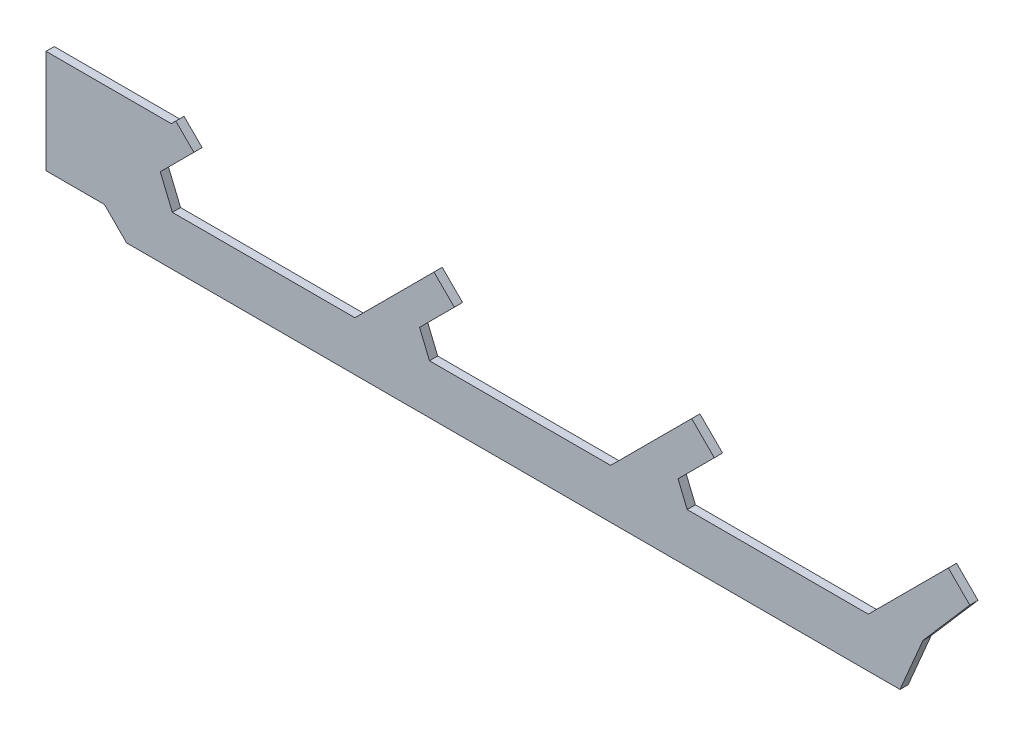
ISO-10303-21;
HEADER;
FILE_DESCRIPTION(('STEP AP214'),'2;1');
FILE_NAME('part.step','',(''),(''),'','','');
FILE_SCHEMA(('AUTOMOTIVE_DESIGN { 1 0 10303 214 1 1 1 1 }'));
ENDSEC;
DATA;
#1=APPLICATION_CONTEXT('core data for automotive mechanical design processes');
#2=APPLICATION_PROTOCOL_DEFINITION('international standard','automotive_design',2000,#1);
#3=PRODUCT_CONTEXT('',#1,'mechanical');
#4=PRODUCT('Part','Part','',(#3));
#5=PRODUCT_RELATED_PRODUCT_CATEGORY('part','',(#4));
#6=PRODUCT_DEFINITION_FORMATION('','',#4);
#7=PRODUCT_DEFINITION_CONTEXT('part definition',#1,'design');
#8=PRODUCT_DEFINITION('design','',#6,#7);
#9=PRODUCT_DEFINITION_SHAPE('','',#8);
#10=(LENGTH_UNIT() NAMED_UNIT(*) SI_UNIT(.MILLI.,.METRE.));
#11=(NAMED_UNIT(*) PLANE_ANGLE_UNIT() SI_UNIT($,.RADIAN.));
#12=(NAMED_UNIT(*) SI_UNIT($,.STERADIAN.) SOLID_ANGLE_UNIT());
#13=UNCERTAINTY_MEASURE_WITH_UNIT(LENGTH_MEASURE(1.E-05),#10,'distance_accuracy_value','');
#14=(GEOMETRIC_REPRESENTATION_CONTEXT(3) GLOBAL_UNCERTAINTY_ASSIGNED_CONTEXT((#13)) GLOBAL_UNIT_ASSIGNED_CONTEXT((#10,
#11,#12)) REPRESENTATION_CONTEXT('',''));
#15=CARTESIAN_POINT('',(0.,0.,0.));
#16=DIRECTION('',(0.,0.,1.));
#17=DIRECTION('',(1.,0.,0.));
#18=AXIS2_PLACEMENT_3D('',#15,#16,#17);
#19=CARTESIAN_POINT('',(35.0999984741211,68.5,0.));
#20=DIRECTION('',(-0.707108322558687,0.707105239811048,0.));
#21=DIRECTION('',(-0.707105239811048,-0.707108322558687,0.));
#22=AXIS2_PLACEMENT_3D('',#19,#20,#21);
#23=PLANE('',#22);
#24=DIRECTION('',(-0.707105239811048,-0.707108322558687,0.));
#25=VECTOR('',#24,1.);
#26=CARTESIAN_POINT('',(35.0999984741211,68.5,0.));
#27=LINE('',#26,#25);
#28=CARTESIAN_POINT('',(35.0999984741211,68.5,0.));
#29=VERTEX_POINT('',#28);
#30=CARTESIAN_POINT('',(34.2250022888184,67.625,0.));
#31=VERTEX_POINT('',#30);
#32=EDGE_CURVE('E11',#29,#31,#27,.T.);
#33=ORIENTED_EDGE('',*,*,#32,.T.);
#34=DIRECTION('',(0.,0.,1.));
#35=VECTOR('',#34,1.);
#36=CARTESIAN_POINT('',(34.2250022888184,67.625,0.));
#37=LINE('',#36,#35);
#38=CARTESIAN_POINT('',(34.2250022888184,67.625,1.59999930858612));
#39=VERTEX_POINT('',#38);
#40=EDGE_CURVE('E349',#31,#39,#37,.T.);
#41=ORIENTED_EDGE('',*,*,#40,.T.);
#42=DIRECTION('',(-0.707105239811048,-0.707108322558687,0.));
#43=VECTOR('',#42,1.);
#44=CARTESIAN_POINT('',(35.0999984741211,68.5,1.59999930858612));
#45=LINE('',#44,#43);
#46=CARTESIAN_POINT('',(35.0999984741211,68.5,1.59999930858612));
#47=VERTEX_POINT('',#46);
#48=EDGE_CURVE('E343',#47,#39,#45,.T.);
#49=ORIENTED_EDGE('',*,*,#48,.F.);
#50=DIRECTION('',(0.,0.,1.));
#51=VECTOR('',#50,1.);
#52=CARTESIAN_POINT('',(35.0999984741211,68.5,0.));
#53=LINE('',#52,#51);
#54=EDGE_CURVE('E193',#29,#47,#53,.T.);
#55=ORIENTED_EDGE('',*,*,#54,.F.);
#56=EDGE_LOOP('',(#33,#41,#49,#55));
#57=FACE_BOUND('',#56,.T.);
#58=ADVANCED_FACE('F17',(#57),#23,.T.);
#59=CARTESIAN_POINT('',(34.2250022888184,67.625,0.));
#60=DIRECTION('',(0.,1.,0.));
#61=DIRECTION('',(-1.,0.,0.));
#62=AXIS2_PLACEMENT_3D('',#59,#60,#61);
#63=PLANE('',#62);
#64=DIRECTION('',(-1.,0.,0.));
#65=VECTOR('',#64,1.);
#66=CARTESIAN_POINT('',(34.2250022888184,67.625,0.));
#67=LINE('',#66,#65);
#68=CARTESIAN_POINT('',(9.87499713897705,67.625,0.));
#69=VERTEX_POINT('',#68);
#70=EDGE_CURVE('E24',#31,#69,#67,.T.);
#71=ORIENTED_EDGE('',*,*,#70,.T.);
#72=DIRECTION('',(0.,0.,1.));
#73=VECTOR('',#72,1.);
#74=CARTESIAN_POINT('',(9.87499713897705,67.625,0.));
#75=LINE('',#74,#73);
#76=CARTESIAN_POINT('',(9.87499713897705,67.625,1.59999930858612));
#77=VERTEX_POINT('',#76);
#78=EDGE_CURVE('E345',#69,#77,#75,.T.);
#79=ORIENTED_EDGE('',*,*,#78,.T.);
#80=DIRECTION('',(-1.,0.,0.));
#81=VECTOR('',#80,1.);
#82=CARTESIAN_POINT('',(34.2250022888184,67.625,1.59999930858612));
#83=LINE('',#82,#81);
#84=EDGE_CURVE('E336',#39,#77,#83,.T.);
#85=ORIENTED_EDGE('',*,*,#84,.F.);
#86=ORIENTED_EDGE('',*,*,#40,.F.);
#87=EDGE_LOOP('',(#71,#79,#85,#86));
#88=FACE_BOUND('',#87,.T.);
#89=ADVANCED_FACE('F351',(#88),#63,.T.);
#90=CARTESIAN_POINT('',(9.87499713897705,67.625,0.));
#91=DIRECTION('',(-0.99999999999999,1.42339406987459E-07,0.));
#92=DIRECTION('',(-1.42339406987459E-07,-0.99999999999999,0.));
#93=AXIS2_PLACEMENT_3D('',#90,#91,#92);
#94=PLANE('',#93);
#95=DIRECTION('',(-1.42339406987459E-07,-0.99999999999999,0.));
#96=VECTOR('',#95,1.);
#97=CARTESIAN_POINT('',(9.87499713897705,67.625,0.));
#98=LINE('',#97,#96);
#99=CARTESIAN_POINT('',(9.8749942779541,47.5249938964844,0.));
#100=VERTEX_POINT('',#99);
#101=EDGE_CURVE('E347',#69,#100,#98,.T.);
#102=ORIENTED_EDGE('',*,*,#101,.T.);
#103=DIRECTION('',(0.,0.,1.));
#104=VECTOR('',#103,1.);
#105=CARTESIAN_POINT('',(9.8749942779541,47.5249938964844,0.));
#106=LINE('',#105,#104);
#107=CARTESIAN_POINT('',(9.8749942779541,47.5249938964844,1.59999930858612));
#108=VERTEX_POINT('',#107);
#109=EDGE_CURVE('E339',#100,#108,#106,.T.);
#110=ORIENTED_EDGE('',*,*,#109,.T.);
#111=DIRECTION('',(-1.42339406987459E-07,-0.99999999999999,0.));
#112=VECTOR('',#111,1.);
#113=CARTESIAN_POINT('',(9.87499713897705,67.625,1.59999930858612));
#114=LINE('',#113,#112);
#115=EDGE_CURVE('E328',#77,#108,#114,.T.);
#116=ORIENTED_EDGE('',*,*,#115,.F.);
#117=ORIENTED_EDGE('',*,*,#78,.F.);
#118=EDGE_LOOP('',(#102,#110,#116,#117));
#119=FACE_BOUND('',#118,.T.);
#120=ADVANCED_FACE('F355',(#119),#94,.T.);
#121=CARTESIAN_POINT('',(9.8749942779541,47.5249938964844,0.));
#122=DIRECTION('',(0.,-1.,0.));
#123=DIRECTION('',(1.,0.,0.));
#124=AXIS2_PLACEMENT_3D('',#121,#122,#123);
#125=PLANE('',#124);
#126=DIRECTION('',(1.,0.,0.));
#127=VECTOR('',#126,1.);
#128=CARTESIAN_POINT('',(9.8749942779541,47.5249938964844,0.));
#129=LINE('',#128,#127);
#130=CARTESIAN_POINT('',(21.2249965667725,47.5249938964844,0.));
#131=VERTEX_POINT('',#130);
#132=EDGE_CURVE('E341',#100,#131,#129,.T.);
#133=ORIENTED_EDGE('',*,*,#132,.T.);
#134=DIRECTION('',(0.,0.,1.));
#135=VECTOR('',#134,1.);
#136=CARTESIAN_POINT('',(21.2249965667725,47.5249938964844,0.));
#137=LINE('',#136,#135);
#138=CARTESIAN_POINT('',(21.2249965667725,47.5249938964844,1.59999930858612));
#139=VERTEX_POINT('',#138);
#140=EDGE_CURVE('E331',#131,#139,#137,.T.);
#141=ORIENTED_EDGE('',*,*,#140,.T.);
#142=DIRECTION('',(1.,0.,0.));
#143=VECTOR('',#142,1.);
#144=CARTESIAN_POINT('',(9.8749942779541,47.5249938964844,1.59999930858612));
#145=LINE('',#144,#143);
#146=EDGE_CURVE('E321',#108,#139,#145,.T.);
#147=ORIENTED_EDGE('',*,*,#146,.F.);
#148=ORIENTED_EDGE('',*,*,#109,.F.);
#149=EDGE_LOOP('',(#133,#141,#147,#148));
#150=FACE_BOUND('',#149,.T.);
#151=ADVANCED_FACE('F360',(#150),#125,.T.);
#152=CARTESIAN_POINT('',(21.2249965667725,47.5249938964844,0.));
#153=DIRECTION('',(-0.70710662526734,-0.707106937105721,0.));
#154=DIRECTION('',(0.707106937105721,-0.70710662526734,0.));
#155=AXIS2_PLACEMENT_3D('',#152,#153,#154);
#156=PLANE('',#155);
#157=DIRECTION('',(0.707106937105721,-0.70710662526734,0.));
#158=VECTOR('',#157,1.);
#159=CARTESIAN_POINT('',(21.2249965667725,47.5249938964844,0.));
#160=LINE('',#159,#158);
#161=CARTESIAN_POINT('',(25.549991607666,43.2000007629395,0.));
#162=VERTEX_POINT('',#161);
#163=EDGE_CURVE('E333',#131,#162,#160,.T.);
#164=ORIENTED_EDGE('',*,*,#163,.T.);
#165=DIRECTION('',(0.,0.,1.));
#166=VECTOR('',#165,1.);
#167=CARTESIAN_POINT('',(25.549991607666,43.2000007629395,0.));
#168=LINE('',#167,#166);
#169=CARTESIAN_POINT('',(25.549991607666,43.2000007629395,1.59999930858612));
#170=VERTEX_POINT('',#169);
#171=EDGE_CURVE('E324',#162,#170,#168,.T.);
#172=ORIENTED_EDGE('',*,*,#171,.T.);
#173=DIRECTION('',(0.707106937105721,-0.70710662526734,0.));
#174=VECTOR('',#173,1.);
#175=CARTESIAN_POINT('',(21.2249965667725,47.5249938964844,1.59999930858612));
#176=LINE('',#175,#174);
#177=EDGE_CURVE('E314',#139,#170,#176,.T.);
#178=ORIENTED_EDGE('',*,*,#177,.F.);
#179=ORIENTED_EDGE('',*,*,#140,.F.);
#180=EDGE_LOOP('',(#164,#172,#178,#179));
#181=FACE_BOUND('',#180,.T.);
#182=ADVANCED_FACE('F365',(#181),#156,.T.);
#183=CARTESIAN_POINT('',(25.549991607666,43.2000007629395,0.));
#184=DIRECTION('',(0.,-1.,0.));
#185=DIRECTION('',(1.,0.,0.));
#186=AXIS2_PLACEMENT_3D('',#183,#184,#185);
#187=PLANE('',#186);
#188=DIRECTION('',(1.,0.,0.));
#189=VECTOR('',#188,1.);
#190=CARTESIAN_POINT('',(25.549991607666,43.2000007629395,0.));
#191=LINE('',#190,#189);
#192=CARTESIAN_POINT('',(175.824981689453,43.2000007629395,0.));
#193=VERTEX_POINT('',#192);
#194=EDGE_CURVE('E326',#162,#193,#191,.T.);
#195=ORIENTED_EDGE('',*,*,#194,.T.);
#196=DIRECTION('',(0.,0.,1.));
#197=VECTOR('',#196,1.);
#198=CARTESIAN_POINT('',(175.824981689453,43.2000007629395,0.));
#199=LINE('',#198,#197);
#200=CARTESIAN_POINT('',(175.824981689453,43.2000007629395,1.59999930858612));
#201=VERTEX_POINT('',#200);
#202=EDGE_CURVE('E317',#193,#201,#199,.T.);
#203=ORIENTED_EDGE('',*,*,#202,.T.);
#204=DIRECTION('',(1.,0.,0.));
#205=VECTOR('',#204,1.);
#206=CARTESIAN_POINT('',(25.549991607666,43.2000007629395,1.59999930858612));
#207=LINE('',#206,#205);
#208=EDGE_CURVE('E307',#170,#201,#207,.T.);
#209=ORIENTED_EDGE('',*,*,#208,.F.);
#210=ORIENTED_EDGE('',*,*,#171,.F.);
#211=EDGE_LOOP('',(#195,#203,#209,#210));
#212=FACE_BOUND('',#211,.T.);
#213=ADVANCED_FACE('F370',(#212),#187,.T.);
#214=CARTESIAN_POINT('',(175.824981689453,43.2000007629395,0.));
#215=DIRECTION('',(0.919935540744426,-0.392069637788059,0.));
#216=DIRECTION('',(0.392069637788059,0.919935540744426,0.));
#217=AXIS2_PLACEMENT_3D('',#214,#215,#216);
#218=PLANE('',#217);
#219=DIRECTION('',(0.392069637788059,0.919935540744426,0.));
#220=VECTOR('',#219,1.);
#221=CARTESIAN_POINT('',(175.824981689453,43.2000007629395,0.));
#222=LINE('',#221,#220);
#223=CARTESIAN_POINT('',(180.300003051758,53.7000007629395,0.));
#224=VERTEX_POINT('',#223);
#225=EDGE_CURVE('E319',#193,#224,#222,.T.);
#226=ORIENTED_EDGE('',*,*,#225,.T.);
#227=DIRECTION('',(0.,0.,1.));
#228=VECTOR('',#227,1.);
#229=CARTESIAN_POINT('',(180.300003051758,53.7000007629395,0.));
#230=LINE('',#229,#228);
#231=CARTESIAN_POINT('',(180.300003051758,53.7000007629395,1.59999930858612));
#232=VERTEX_POINT('',#231);
#233=EDGE_CURVE('E310',#224,#232,#230,.T.);
#234=ORIENTED_EDGE('',*,*,#233,.T.);
#235=DIRECTION('',(0.392069637788059,0.919935540744426,0.));
#236=VECTOR('',#235,1.);
#237=CARTESIAN_POINT('',(175.824981689453,43.2000007629395,1.59999930858612));
#238=LINE('',#237,#236);
#239=EDGE_CURVE('E300',#201,#232,#238,.T.);
#240=ORIENTED_EDGE('',*,*,#239,.F.);
#241=ORIENTED_EDGE('',*,*,#202,.F.);
#242=EDGE_LOOP('',(#226,#234,#240,#241));
#243=FACE_BOUND('',#242,.T.);
#244=ADVANCED_FACE('F375',(#243),#218,.T.);
#245=CARTESIAN_POINT('',(180.300003051758,53.7000007629395,0.));
#246=DIRECTION('',(0.755748715648065,-0.654861724943747,0.));
#247=DIRECTION('',(0.654861724943747,0.755748715648065,0.));
#248=AXIS2_PLACEMENT_3D('',#245,#246,#247);
#249=PLANE('',#248);
#250=DIRECTION('',(0.654861724943747,0.755748715648065,0.));
#251=VECTOR('',#250,1.);
#252=CARTESIAN_POINT('',(180.300003051758,53.7000007629395,0.));
#253=LINE('',#252,#251);
#254=CARTESIAN_POINT('',(189.387496948242,64.1875,0.));
#255=VERTEX_POINT('',#254);
#256=EDGE_CURVE('E312',#224,#255,#253,.T.);
#257=ORIENTED_EDGE('',*,*,#256,.T.);
#258=DIRECTION('',(0.,0.,1.));
#259=VECTOR('',#258,1.);
#260=CARTESIAN_POINT('',(189.387496948242,64.1875,0.));
#261=LINE('',#260,#259);
#262=CARTESIAN_POINT('',(189.387496948242,64.1875,1.59999930858612));
#263=VERTEX_POINT('',#262);
#264=EDGE_CURVE('E303',#255,#263,#261,.T.);
#265=ORIENTED_EDGE('',*,*,#264,.T.);
#266=DIRECTION('',(0.654861724943747,0.755748715648065,0.));
#267=VECTOR('',#266,1.);
#268=CARTESIAN_POINT('',(180.300003051758,53.7000007629395,1.59999930858612));
#269=LINE('',#268,#267);
#270=EDGE_CURVE('E293',#232,#263,#269,.T.);
#271=ORIENTED_EDGE('',*,*,#270,.F.);
#272=ORIENTED_EDGE('',*,*,#233,.F.);
#273=EDGE_LOOP('',(#257,#265,#271,#272));
#274=FACE_BOUND('',#273,.T.);
#275=ADVANCED_FACE('F380',(#274),#249,.T.);
#276=CARTESIAN_POINT('',(189.387496948242,64.1875,0.));
#277=DIRECTION('',(0.70710613316299,0.707107429209511,0.));
#278=DIRECTION('',(-0.707107429209511,0.70710613316299,0.));
#279=AXIS2_PLACEMENT_3D('',#276,#277,#278);
#280=PLANE('',#279);
#281=DIRECTION('',(-0.707107429209511,0.70710613316299,0.));
#282=VECTOR('',#281,1.);
#283=CARTESIAN_POINT('',(189.387496948242,64.1875,0.));
#284=LINE('',#283,#282);
#285=CARTESIAN_POINT('',(185.224990844727,68.3499984741211,0.));
#286=VERTEX_POINT('',#285);
#287=EDGE_CURVE('E305',#255,#286,#284,.T.);
#288=ORIENTED_EDGE('',*,*,#287,.T.);
#289=DIRECTION('',(0.,0.,1.));
#290=VECTOR('',#289,1.);
#291=CARTESIAN_POINT('',(185.224990844727,68.3499984741211,0.));
#292=LINE('',#291,#290);
#293=CARTESIAN_POINT('',(185.224990844727,68.3499984741211,1.59999930858612));
#294=VERTEX_POINT('',#293);
#295=EDGE_CURVE('E296',#286,#294,#292,.T.);
#296=ORIENTED_EDGE('',*,*,#295,.T.);
#297=DIRECTION('',(-0.707107429209511,0.70710613316299,0.));
#298=VECTOR('',#297,1.);
#299=CARTESIAN_POINT('',(189.387496948242,64.1875,1.59999930858612));
#300=LINE('',#299,#298);
#301=EDGE_CURVE('E286',#263,#294,#300,.T.);
#302=ORIENTED_EDGE('',*,*,#301,.F.);
#303=ORIENTED_EDGE('',*,*,#264,.F.);
#304=EDGE_LOOP('',(#288,#296,#302,#303));
#305=FACE_BOUND('',#304,.T.);
#306=ADVANCED_FACE('F385',(#305),#280,.T.);
#307=CARTESIAN_POINT('',(185.224990844727,68.3499984741211,0.));
#308=DIRECTION('',(-0.707106781186548,0.707106781186548,0.));
#309=DIRECTION('',(-0.707106781186548,-0.707106781186548,0.));
#310=AXIS2_PLACEMENT_3D('',#307,#308,#309);
#311=PLANE('',#310);
#312=DIRECTION('',(-0.707106781186548,-0.707106781186548,0.));
#313=VECTOR('',#312,1.);
#314=CARTESIAN_POINT('',(185.224990844727,68.3499984741211,0.));
#315=LINE('',#314,#313);
#316=CARTESIAN_POINT('',(169.674957275391,52.7999649047852,0.));
#317=VERTEX_POINT('',#316);
#318=EDGE_CURVE('E298',#286,#317,#315,.T.);
#319=ORIENTED_EDGE('',*,*,#318,.T.);
#320=DIRECTION('',(0.,0.,1.));
#321=VECTOR('',#320,1.);
#322=CARTESIAN_POINT('',(169.674957275391,52.7999649047852,0.));
#323=LINE('',#322,#321);
#324=CARTESIAN_POINT('',(169.674957275391,52.7999649047852,1.59999930858612));
#325=VERTEX_POINT('',#324);
#326=EDGE_CURVE('E289',#317,#325,#323,.T.);
#327=ORIENTED_EDGE('',*,*,#326,.T.);
#328=DIRECTION('',(-0.707106781186548,-0.707106781186548,0.));
#329=VECTOR('',#328,1.);
#330=CARTESIAN_POINT('',(185.224990844727,68.3499984741211,1.59999930858612));
#331=LINE('',#330,#329);
#332=EDGE_CURVE('E279',#294,#325,#331,.T.);
#333=ORIENTED_EDGE('',*,*,#332,.F.);
#334=ORIENTED_EDGE('',*,*,#295,.F.);
#335=EDGE_LOOP('',(#319,#327,#333,#334));
#336=FACE_BOUND('',#335,.T.);
#337=ADVANCED_FACE('F390',(#336),#311,.T.);
#338=CARTESIAN_POINT('',(169.674957275391,52.7999649047852,0.));
#339=DIRECTION('',(3.25100347640621E-07,0.999999999999947,0.));
#340=DIRECTION('',(-0.999999999999947,3.25100347640621E-07,0.));
#341=AXIS2_PLACEMENT_3D('',#338,#339,#340);
#342=PLANE('',#341);
#343=DIRECTION('',(-0.999999999999947,3.25100347640621E-07,0.));
#344=VECTOR('',#343,1.);
#345=CARTESIAN_POINT('',(169.674957275391,52.7999649047852,0.));
#346=LINE('',#345,#344);
#347=CARTESIAN_POINT('',(134.473236083984,52.799976348877,0.));
#348=VERTEX_POINT('',#347);
#349=EDGE_CURVE('E291',#317,#348,#346,.T.);
#350=ORIENTED_EDGE('',*,*,#349,.T.);
#351=DIRECTION('',(0.,0.,1.));
#352=VECTOR('',#351,1.);
#353=CARTESIAN_POINT('',(134.473236083984,52.799976348877,0.));
#354=LINE('',#353,#352);
#355=CARTESIAN_POINT('',(134.473236083984,52.799976348877,1.59999930858612));
#356=VERTEX_POINT('',#355);
#357=EDGE_CURVE('E282',#348,#356,#354,.T.);
#358=ORIENTED_EDGE('',*,*,#357,.T.);
#359=DIRECTION('',(-0.999999999999947,3.25100347640621E-07,0.));
#360=VECTOR('',#359,1.);
#361=CARTESIAN_POINT('',(169.674957275391,52.7999649047852,1.59999930858612));
#362=LINE('',#361,#360);
#363=EDGE_CURVE('E272',#325,#356,#362,.T.);
#364=ORIENTED_EDGE('',*,*,#363,.F.);
#365=ORIENTED_EDGE('',*,*,#326,.F.);
#366=EDGE_LOOP('',(#350,#358,#364,#365));
#367=FACE_BOUND('',#366,.T.);
#368=ADVANCED_FACE('F395',(#367),#342,.T.);
#369=CARTESIAN_POINT('',(134.473236083984,52.799976348877,0.));
#370=DIRECTION('',(0.923878799643942,0.382685201658582,0.));
#371=DIRECTION('',(-0.382685201658582,0.923878799643942,0.));
#372=AXIS2_PLACEMENT_3D('',#369,#370,#371);
#373=PLANE('',#372);
#374=DIRECTION('',(-0.382685201658582,0.923878799643942,0.));
#375=VECTOR('',#374,1.);
#376=CARTESIAN_POINT('',(134.473236083984,52.799976348877,0.));
#377=LINE('',#376,#375);
#378=CARTESIAN_POINT('',(132.694412231445,57.0944137573242,0.));
#379=VERTEX_POINT('',#378);
#380=EDGE_CURVE('E284',#348,#379,#377,.T.);
#381=ORIENTED_EDGE('',*,*,#380,.T.);
#382=DIRECTION('',(0.,0.,1.));
#383=VECTOR('',#382,1.);
#384=CARTESIAN_POINT('',(132.694412231445,57.0944137573242,0.));
#385=LINE('',#384,#383);
#386=CARTESIAN_POINT('',(132.694412231445,57.0944137573242,1.59999930858612));
#387=VERTEX_POINT('',#386);
#388=EDGE_CURVE('E275',#379,#387,#385,.T.);
#389=ORIENTED_EDGE('',*,*,#388,.T.);
#390=DIRECTION('',(-0.382685201658582,0.923878799643942,0.));
#391=VECTOR('',#390,1.);
#392=CARTESIAN_POINT('',(134.473236083984,52.799976348877,1.59999930858612));
#393=LINE('',#392,#391);
#394=EDGE_CURVE('E265',#356,#387,#393,.T.);
#395=ORIENTED_EDGE('',*,*,#394,.F.);
#396=ORIENTED_EDGE('',*,*,#357,.F.);
#397=EDGE_LOOP('',(#381,#389,#395,#396));
#398=FACE_BOUND('',#397,.T.);
#399=ADVANCED_FACE('F400',(#398),#373,.T.);
#400=CARTESIAN_POINT('',(132.694412231445,57.0944137573242,0.));
#401=DIRECTION('',(0.707106398879562,-0.707107163493327,0.));
#402=DIRECTION('',(0.707107163493327,0.707106398879562,0.));
#403=AXIS2_PLACEMENT_3D('',#400,#401,#402);
#404=PLANE('',#403);
#405=DIRECTION('',(0.707107163493327,0.707106398879562,0.));
#406=VECTOR('',#405,1.);
#407=CARTESIAN_POINT('',(132.694412231445,57.0944137573242,0.));
#408=LINE('',#407,#406);
#409=CARTESIAN_POINT('',(139.75,64.1499938964844,0.));
#410=VERTEX_POINT('',#409);
#411=EDGE_CURVE('E277',#379,#410,#408,.T.);
#412=ORIENTED_EDGE('',*,*,#411,.T.);
#413=DIRECTION('',(0.,0.,1.));
#414=VECTOR('',#413,1.);
#415=CARTESIAN_POINT('',(139.75,64.1499938964844,0.));
#416=LINE('',#415,#414);
#417=CARTESIAN_POINT('',(139.75,64.1499938964844,1.59999930858612));
#418=VERTEX_POINT('',#417);
#419=EDGE_CURVE('E268',#410,#418,#416,.T.);
#420=ORIENTED_EDGE('',*,*,#419,.T.);
#421=DIRECTION('',(0.707107163493327,0.707106398879562,0.));
#422=VECTOR('',#421,1.);
#423=CARTESIAN_POINT('',(132.694412231445,57.0944137573242,1.59999930858612));
#424=LINE('',#423,#422);
#425=EDGE_CURVE('E258',#387,#418,#424,.T.);
#426=ORIENTED_EDGE('',*,*,#425,.F.);
#427=ORIENTED_EDGE('',*,*,#388,.F.);
#428=EDGE_LOOP('',(#412,#420,#426,#427));
#429=FACE_BOUND('',#428,.T.);
#430=ADVANCED_FACE('F405',(#429),#404,.T.);
#431=CARTESIAN_POINT('',(139.75,64.1499938964844,0.));
#432=DIRECTION('',(0.707108007275198,0.707105555095771,0.));
#433=DIRECTION('',(-0.707105555095771,0.707108007275198,0.));
#434=AXIS2_PLACEMENT_3D('',#431,#432,#433);
#435=PLANE('',#434);
#436=DIRECTION('',(-0.707105555095771,0.707108007275198,0.));
#437=VECTOR('',#436,1.);
#438=CARTESIAN_POINT('',(139.75,64.1499938964844,0.));
#439=LINE('',#438,#437);
#440=CARTESIAN_POINT('',(135.350006103516,68.5500030517578,0.));
#441=VERTEX_POINT('',#440);
#442=EDGE_CURVE('E270',#410,#441,#439,.T.);
#443=ORIENTED_EDGE('',*,*,#442,.T.);
#444=DIRECTION('',(0.,0.,1.));
#445=VECTOR('',#444,1.);
#446=CARTESIAN_POINT('',(135.350006103516,68.5500030517578,0.));
#447=LINE('',#446,#445);
#448=CARTESIAN_POINT('',(135.350006103516,68.5500030517578,1.59999930858612));
#449=VERTEX_POINT('',#448);
#450=EDGE_CURVE('E261',#441,#449,#447,.T.);
#451=ORIENTED_EDGE('',*,*,#450,.T.);
#452=DIRECTION('',(-0.707105555095771,0.707108007275198,0.));
#453=VECTOR('',#452,1.);
#454=CARTESIAN_POINT('',(139.75,64.1499938964844,1.59999930858612));
#455=LINE('',#454,#453);
#456=EDGE_CURVE('E251',#418,#449,#455,.T.);
#457=ORIENTED_EDGE('',*,*,#456,.F.);
#458=ORIENTED_EDGE('',*,*,#419,.F.);
#459=EDGE_LOOP('',(#443,#451,#457,#458));
#460=FACE_BOUND('',#459,.T.);
#461=ADVANCED_FACE('F410',(#460),#435,.T.);
#462=CARTESIAN_POINT('',(135.350006103516,68.5500030517578,0.));
#463=DIRECTION('',(-0.707106866818224,0.707106695554861,0.));
#464=DIRECTION('',(-0.707106695554861,-0.707106866818224,0.));
#465=AXIS2_PLACEMENT_3D('',#462,#463,#464);
#466=PLANE('',#465);
#467=DIRECTION('',(-0.707106695554861,-0.707106866818224,0.));
#468=VECTOR('',#467,1.);
#469=CARTESIAN_POINT('',(135.350006103516,68.5500030517578,0.));
#470=LINE('',#469,#468);
#471=CARTESIAN_POINT('',(119.600006103516,52.7999992370605,0.));
#472=VERTEX_POINT('',#471);
#473=EDGE_CURVE('E263',#441,#472,#470,.T.);
#474=ORIENTED_EDGE('',*,*,#473,.T.);
#475=DIRECTION('',(0.,0.,1.));
#476=VECTOR('',#475,1.);
#477=CARTESIAN_POINT('',(119.600006103516,52.7999992370605,0.));
#478=LINE('',#477,#476);
#479=CARTESIAN_POINT('',(119.600006103516,52.7999992370605,1.59999930858612));
#480=VERTEX_POINT('',#479);
#481=EDGE_CURVE('E254',#472,#480,#478,.T.);
#482=ORIENTED_EDGE('',*,*,#481,.T.);
#483=DIRECTION('',(-0.707106695554861,-0.707106866818224,0.));
#484=VECTOR('',#483,1.);
#485=CARTESIAN_POINT('',(135.350006103516,68.5500030517578,1.59999930858612));
#486=LINE('',#485,#484);
#487=EDGE_CURVE('E244',#449,#480,#486,.T.);
#488=ORIENTED_EDGE('',*,*,#487,.F.);
#489=ORIENTED_EDGE('',*,*,#450,.F.);
#490=EDGE_LOOP('',(#474,#482,#488,#489));
#491=FACE_BOUND('',#490,.T.);
#492=ADVANCED_FACE('F415',(#491),#466,.T.);
#493=CARTESIAN_POINT('',(119.600006103516,52.7999992370605,0.));
#494=DIRECTION('',(0.,1.,0.));
#495=DIRECTION('',(-1.,0.,0.));
#496=AXIS2_PLACEMENT_3D('',#493,#494,#495);
#497=PLANE('',#496);
#498=DIRECTION('',(-1.,0.,0.));
#499=VECTOR('',#498,1.);
#500=CARTESIAN_POINT('',(119.600006103516,52.7999992370605,0.));
#501=LINE('',#500,#499);
#502=CARTESIAN_POINT('',(84.3964462280273,52.7999992370605,0.));
#503=VERTEX_POINT('',#502);
#504=EDGE_CURVE('E256',#472,#503,#501,.T.);
#505=ORIENTED_EDGE('',*,*,#504,.T.);
#506=DIRECTION('',(0.,0.,1.));
#507=VECTOR('',#506,1.);
#508=CARTESIAN_POINT('',(84.3964462280273,52.7999992370605,0.));
#509=LINE('',#508,#507);
#510=CARTESIAN_POINT('',(84.3964462280273,52.7999992370605,1.59999930858612));
#511=VERTEX_POINT('',#510);
#512=EDGE_CURVE('E247',#503,#511,#509,.T.);
#513=ORIENTED_EDGE('',*,*,#512,.T.);
#514=DIRECTION('',(-1.,0.,0.));
#515=VECTOR('',#514,1.);
#516=CARTESIAN_POINT('',(119.600006103516,52.7999992370605,1.59999930858612));
#517=LINE('',#516,#515);
#518=EDGE_CURVE('E237',#480,#511,#517,.T.);
#519=ORIENTED_EDGE('',*,*,#518,.F.);
#520=ORIENTED_EDGE('',*,*,#481,.F.);
#521=EDGE_LOOP('',(#505,#513,#519,#520));
#522=FACE_BOUND('',#521,.T.);
#523=ADVANCED_FACE('F420',(#522),#497,.T.);
#524=CARTESIAN_POINT('',(84.3964462280273,52.7999992370605,0.));
#525=DIRECTION('',(0.923878328049887,0.382686340179193,0.));
#526=DIRECTION('',(-0.382686340179193,0.923878328049887,0.));
#527=AXIS2_PLACEMENT_3D('',#524,#525,#526);
#528=PLANE('',#527);
#529=DIRECTION('',(-0.382686340179193,0.923878328049887,0.));
#530=VECTOR('',#529,1.);
#531=CARTESIAN_POINT('',(84.3964462280273,52.7999992370605,0.));
#532=LINE('',#531,#530);
#533=CARTESIAN_POINT('',(82.4643783569336,57.4643821716309,0.));
#534=VERTEX_POINT('',#533);
#535=EDGE_CURVE('E249',#503,#534,#532,.T.);
#536=ORIENTED_EDGE('',*,*,#535,.T.);
#537=DIRECTION('',(0.,0.,1.));
#538=VECTOR('',#537,1.);
#539=CARTESIAN_POINT('',(82.4643783569336,57.4643821716309,0.));
#540=LINE('',#539,#538);
#541=CARTESIAN_POINT('',(82.4643783569336,57.4643821716309,1.59999930858612));
#542=VERTEX_POINT('',#541);
#543=EDGE_CURVE('E240',#534,#542,#540,.T.);
#544=ORIENTED_EDGE('',*,*,#543,.T.);
#545=DIRECTION('',(-0.382686340179193,0.923878328049887,0.));
#546=VECTOR('',#545,1.);
#547=CARTESIAN_POINT('',(84.3964462280273,52.7999992370605,1.59999930858612));
#548=LINE('',#547,#546);
#549=EDGE_CURVE('E230',#511,#542,#548,.T.);
#550=ORIENTED_EDGE('',*,*,#549,.F.);
#551=ORIENTED_EDGE('',*,*,#512,.F.);
#552=EDGE_LOOP('',(#536,#544,#550,#551));
#553=FACE_BOUND('',#552,.T.);
#554=ADVANCED_FACE('F425',(#553),#528,.T.);
#555=CARTESIAN_POINT('',(82.4643783569336,57.4643821716309,0.));
#556=DIRECTION('',(0.707106581693054,-0.707106980679984,0.));
#557=DIRECTION('',(0.707106980679984,0.707106581693054,0.));
#558=AXIS2_PLACEMENT_3D('',#555,#556,#557);
#559=PLANE('',#558);
#560=DIRECTION('',(0.707106980679984,0.707106581693054,0.));
#561=VECTOR('',#560,1.);
#562=CARTESIAN_POINT('',(82.4643783569336,57.4643821716309,0.));
#563=LINE('',#562,#561);
#564=CARTESIAN_POINT('',(89.2249984741211,64.2249984741211,0.));
#565=VERTEX_POINT('',#564);
#566=EDGE_CURVE('E242',#534,#565,#563,.T.);
#567=ORIENTED_EDGE('',*,*,#566,.T.);
#568=DIRECTION('',(0.,0.,1.));
#569=VECTOR('',#568,1.);
#570=CARTESIAN_POINT('',(89.2249984741211,64.2249984741211,0.));
#571=LINE('',#570,#569);
#572=CARTESIAN_POINT('',(89.2249984741211,64.2249984741211,1.59999930858612));
#573=VERTEX_POINT('',#572);
#574=EDGE_CURVE('E233',#565,#573,#571,.T.);
#575=ORIENTED_EDGE('',*,*,#574,.T.);
#576=DIRECTION('',(0.707106980679984,0.707106581693054,0.));
#577=VECTOR('',#576,1.);
#578=CARTESIAN_POINT('',(82.4643783569336,57.4643821716309,1.59999930858612));
#579=LINE('',#578,#577);
#580=EDGE_CURVE('E223',#542,#573,#579,.T.);
#581=ORIENTED_EDGE('',*,*,#580,.F.);
#582=ORIENTED_EDGE('',*,*,#543,.F.);
#583=EDGE_LOOP('',(#567,#575,#581,#582));
#584=FACE_BOUND('',#583,.T.);
#585=ADVANCED_FACE('F430',(#584),#559,.T.);
#586=CARTESIAN_POINT('',(89.2249984741211,64.2249984741211,0.));
#587=DIRECTION('',(0.707106098300703,0.707107464071733,0.));
#588=DIRECTION('',(-0.707107464071733,0.707106098300703,0.));
#589=AXIS2_PLACEMENT_3D('',#586,#587,#588);
#590=PLANE('',#589);
#591=DIRECTION('',(-0.707107464071733,0.707106098300703,0.));
#592=VECTOR('',#591,1.);
#593=CARTESIAN_POINT('',(89.2249984741211,64.2249984741211,0.));
#594=LINE('',#593,#592);
#595=CARTESIAN_POINT('',(85.2749938964844,68.1749954223633,0.));
#596=VERTEX_POINT('',#595);
#597=EDGE_CURVE('E235',#565,#596,#594,.T.);
#598=ORIENTED_EDGE('',*,*,#597,.T.);
#599=DIRECTION('',(0.,0.,1.));
#600=VECTOR('',#599,1.);
#601=CARTESIAN_POINT('',(85.2749938964844,68.1749954223633,0.));
#602=LINE('',#601,#600);
#603=CARTESIAN_POINT('',(85.2749938964844,68.1749954223633,1.59999930858612));
#604=VERTEX_POINT('',#603);
#605=EDGE_CURVE('E226',#596,#604,#602,.T.);
#606=ORIENTED_EDGE('',*,*,#605,.T.);
#607=DIRECTION('',(-0.707107464071733,0.707106098300703,0.));
#608=VECTOR('',#607,1.);
#609=CARTESIAN_POINT('',(89.2249984741211,64.2249984741211,1.59999930858612));
#610=LINE('',#609,#608);
#611=EDGE_CURVE('E216',#573,#604,#610,.T.);
#612=ORIENTED_EDGE('',*,*,#611,.F.);
#613=ORIENTED_EDGE('',*,*,#574,.F.);
#614=EDGE_LOOP('',(#598,#606,#612,#613));
#615=FACE_BOUND('',#614,.T.);
#616=ADVANCED_FACE('F435',(#615),#590,.T.);
#617=CARTESIAN_POINT('',(85.2749938964844,68.1749954223633,0.));
#618=DIRECTION('',(-0.707106693466261,0.707106868906823,0.));
#619=DIRECTION('',(-0.707106868906823,-0.707106693466261,0.));
#620=AXIS2_PLACEMENT_3D('',#617,#618,#619);
#621=PLANE('',#620);
#622=DIRECTION('',(-0.707106868906823,-0.707106693466261,0.));
#623=VECTOR('',#622,1.);
#624=CARTESIAN_POINT('',(85.2749938964844,68.1749954223633,0.));
#625=LINE('',#624,#623);
#626=CARTESIAN_POINT('',(69.8999938964844,52.7999992370605,0.));
#627=VERTEX_POINT('',#626);
#628=EDGE_CURVE('E228',#596,#627,#625,.T.);
#629=ORIENTED_EDGE('',*,*,#628,.T.);
#630=DIRECTION('',(0.,0.,1.));
#631=VECTOR('',#630,1.);
#632=CARTESIAN_POINT('',(69.8999938964844,52.7999992370605,0.));
#633=LINE('',#632,#631);
#634=CARTESIAN_POINT('',(69.8999938964844,52.7999992370605,1.59999930858612));
#635=VERTEX_POINT('',#634);
#636=EDGE_CURVE('E219',#627,#635,#633,.T.);
#637=ORIENTED_EDGE('',*,*,#636,.T.);
#638=DIRECTION('',(-0.707106868906823,-0.707106693466261,0.));
#639=VECTOR('',#638,1.);
#640=CARTESIAN_POINT('',(85.2749938964844,68.1749954223633,1.59999930858612));
#641=LINE('',#640,#639);
#642=EDGE_CURVE('E209',#604,#635,#641,.T.);
#643=ORIENTED_EDGE('',*,*,#642,.F.);
#644=ORIENTED_EDGE('',*,*,#605,.F.);
#645=EDGE_LOOP('',(#629,#637,#643,#644));
#646=FACE_BOUND('',#645,.T.);
#647=ADVANCED_FACE('F440',(#646),#621,.T.);
#648=CARTESIAN_POINT('',(69.8999938964844,52.7999992370605,0.));
#649=DIRECTION('',(0.,1.,0.));
#650=DIRECTION('',(-1.,0.,0.));
#651=AXIS2_PLACEMENT_3D('',#648,#649,#650);
#652=PLANE('',#651);
#653=DIRECTION('',(-1.,0.,0.));
#654=VECTOR('',#653,1.);
#655=CARTESIAN_POINT('',(69.8999938964844,52.7999992370605,0.));
#656=LINE('',#655,#654);
#657=CARTESIAN_POINT('',(34.4282455444336,52.7999992370605,0.));
#658=VERTEX_POINT('',#657);
#659=EDGE_CURVE('E221',#627,#658,#656,.T.);
#660=ORIENTED_EDGE('',*,*,#659,.T.);
#661=DIRECTION('',(0.,0.,1.));
#662=VECTOR('',#661,1.);
#663=CARTESIAN_POINT('',(34.4282455444336,52.7999992370605,0.));
#664=LINE('',#663,#662);
#665=CARTESIAN_POINT('',(34.4282455444336,52.7999992370605,1.59999930858612));
#666=VERTEX_POINT('',#665);
#667=EDGE_CURVE('E212',#658,#666,#664,.T.);
#668=ORIENTED_EDGE('',*,*,#667,.T.);
#669=DIRECTION('',(-1.,0.,0.));
#670=VECTOR('',#669,1.);
#671=CARTESIAN_POINT('',(69.8999938964844,52.7999992370605,1.59999930858612));
#672=LINE('',#671,#670);
#673=EDGE_CURVE('E204',#635,#666,#672,.T.);
#674=ORIENTED_EDGE('',*,*,#673,.F.);
#675=ORIENTED_EDGE('',*,*,#636,.F.);
#676=EDGE_LOOP('',(#660,#668,#674,#675));
#677=FACE_BOUND('',#676,.T.);
#678=ADVANCED_FACE('F444',(#677),#652,.T.);
#679=CARTESIAN_POINT('',(34.4282455444336,52.7999992370605,0.));
#680=DIRECTION('',(0.923879395146937,0.382683763991798,0.));
#681=DIRECTION('',(-0.382683763991798,0.923879395146937,0.));
#682=AXIS2_PLACEMENT_3D('',#679,#680,#681);
#683=PLANE('',#682);
#684=DIRECTION('',(-0.382683763991798,0.923879395146937,0.));
#685=VECTOR('',#684,1.);
#686=CARTESIAN_POINT('',(34.4282455444336,52.7999992370605,0.));
#687=LINE('',#686,#685);
#688=CARTESIAN_POINT('',(32.0841484069824,58.4591445922852,0.));
#689=VERTEX_POINT('',#688);
#690=EDGE_CURVE('E214',#658,#689,#687,.T.);
#691=ORIENTED_EDGE('',*,*,#690,.T.);
#692=DIRECTION('',(0.,0.,1.));
#693=VECTOR('',#692,1.);
#694=CARTESIAN_POINT('',(32.0841484069824,58.4591445922852,0.));
#695=LINE('',#694,#693);
#696=CARTESIAN_POINT('',(32.0841484069824,58.4591445922852,1.59999930858612));
#697=VERTEX_POINT('',#696);
#698=EDGE_CURVE('E206',#689,#697,#695,.T.);
#699=ORIENTED_EDGE('',*,*,#698,.T.);
#700=DIRECTION('',(-0.382683763991798,0.923879395146937,0.));
#701=VECTOR('',#700,1.);
#702=CARTESIAN_POINT('',(34.4282455444336,52.7999992370605,1.59999930858612));
#703=LINE('',#702,#701);
#704=EDGE_CURVE('E187',#666,#697,#703,.T.);
#705=ORIENTED_EDGE('',*,*,#704,.F.);
#706=ORIENTED_EDGE('',*,*,#667,.F.);
#707=EDGE_LOOP('',(#691,#699,#705,#706));
#708=FACE_BOUND('',#707,.T.);
#709=ADVANCED_FACE('F449',(#708),#683,.T.);
#710=CARTESIAN_POINT('',(32.0841484069824,58.4591445922852,0.));
#711=DIRECTION('',(0.707107607550448,-0.707105954821681,0.));
#712=DIRECTION('',(0.707105954821681,0.707107607550448,0.));
#713=AXIS2_PLACEMENT_3D('',#710,#711,#712);
#714=PLANE('',#713);
#715=DIRECTION('',(0.707105954821681,0.707107607550448,0.));
#716=VECTOR('',#715,1.);
#717=CARTESIAN_POINT('',(32.0841484069824,58.4591445922852,0.));
#718=LINE('',#717,#716);
#719=CARTESIAN_POINT('',(38.612491607666,64.9875030517578,0.));
#720=VERTEX_POINT('',#719);
#721=EDGE_CURVE('E182',#689,#720,#718,.T.);
#722=ORIENTED_EDGE('',*,*,#721,.T.);
#723=DIRECTION('',(0.,0.,1.));
#724=VECTOR('',#723,1.);
#725=CARTESIAN_POINT('',(38.612491607666,64.9875030517578,0.));
#726=LINE('',#725,#724);
#727=CARTESIAN_POINT('',(38.612491607666,64.9875030517578,1.59999930858612));
#728=VERTEX_POINT('',#727);
#729=EDGE_CURVE('E174',#720,#728,#726,.T.);
#730=ORIENTED_EDGE('',*,*,#729,.T.);
#731=DIRECTION('',(0.707105954821681,0.707107607550448,0.));
#732=VECTOR('',#731,1.);
#733=CARTESIAN_POINT('',(32.0841484069824,58.4591445922852,1.59999930858612));
#734=LINE('',#733,#732);
#735=EDGE_CURVE('E179',#697,#728,#734,.T.);
#736=ORIENTED_EDGE('',*,*,#735,.F.);
#737=ORIENTED_EDGE('',*,*,#698,.F.);
#738=EDGE_LOOP('',(#722,#730,#736,#737));
#739=FACE_BOUND('',#738,.T.);
#740=ADVANCED_FACE('F176',(#739),#714,.T.);
#741=CARTESIAN_POINT('',(38.612491607666,64.9875030517578,0.));
#742=DIRECTION('',(0.707107165158274,0.707106397214612,0.));
#743=DIRECTION('',(-0.707106397214612,0.707107165158274,0.));
#744=AXIS2_PLACEMENT_3D('',#741,#742,#743);
#745=PLANE('',#744);
#746=DIRECTION('',(-0.707106397214612,0.707107165158274,0.));
#747=VECTOR('',#746,1.);
#748=CARTESIAN_POINT('',(38.612491607666,64.9875030517578,0.));
#749=LINE('',#748,#747);
#750=EDGE_CURVE('E186',#720,#29,#749,.T.);
#751=ORIENTED_EDGE('',*,*,#750,.T.);
#752=ORIENTED_EDGE('',*,*,#54,.T.);
#753=DIRECTION('',(-0.707106397214612,0.707107165158274,0.));
#754=VECTOR('',#753,1.);
#755=CARTESIAN_POINT('',(38.612491607666,64.9875030517578,1.59999930858612));
#756=LINE('',#755,#754);
#757=EDGE_CURVE('E191',#728,#47,#756,.T.);
#758=ORIENTED_EDGE('',*,*,#757,.F.);
#759=ORIENTED_EDGE('',*,*,#729,.F.);
#760=EDGE_LOOP('',(#751,#752,#758,#759));
#761=FACE_BOUND('',#760,.T.);
#762=ADVANCED_FACE('F192',(#761),#745,.T.);
#763=CARTESIAN_POINT('',(0.,0.,1.59999930858612));
#764=DIRECTION('',(0.,0.,1.));
#765=DIRECTION('',(1.,0.,0.));
#766=AXIS2_PLACEMENT_3D('',#763,#764,#765);
#767=PLANE('',#766);
#768=ORIENTED_EDGE('',*,*,#48,.T.);
#769=ORIENTED_EDGE('',*,*,#84,.T.);
#770=ORIENTED_EDGE('',*,*,#115,.T.);
#771=ORIENTED_EDGE('',*,*,#146,.T.);
#772=ORIENTED_EDGE('',*,*,#177,.T.);
#773=ORIENTED_EDGE('',*,*,#208,.T.);
#774=ORIENTED_EDGE('',*,*,#239,.T.);
#775=ORIENTED_EDGE('',*,*,#270,.T.);
#776=ORIENTED_EDGE('',*,*,#301,.T.);
#777=ORIENTED_EDGE('',*,*,#332,.T.);
#778=ORIENTED_EDGE('',*,*,#363,.T.);
#779=ORIENTED_EDGE('',*,*,#394,.T.);
#780=ORIENTED_EDGE('',*,*,#425,.T.);
#781=ORIENTED_EDGE('',*,*,#456,.T.);
#782=ORIENTED_EDGE('',*,*,#487,.T.);
#783=ORIENTED_EDGE('',*,*,#518,.T.);
#784=ORIENTED_EDGE('',*,*,#549,.T.);
#785=ORIENTED_EDGE('',*,*,#580,.T.);
#786=ORIENTED_EDGE('',*,*,#611,.T.);
#787=ORIENTED_EDGE('',*,*,#642,.T.);
#788=ORIENTED_EDGE('',*,*,#673,.T.);
#789=ORIENTED_EDGE('',*,*,#704,.T.);
#790=ORIENTED_EDGE('',*,*,#735,.T.);
#791=ORIENTED_EDGE('',*,*,#757,.T.);
#792=EDGE_LOOP('',(#768,#769,#770,#771,#772,#773,#774,#775,#776,#777,#778,#779,#780,#781,#782,
#783,#784,#785,#786,#787,#788,#789,#790,#791));
#793=FACE_BOUND('',#792,.T.);
#794=ADVANCED_FACE('F197',(#793),#767,.T.);
#795=CARTESIAN_POINT('',(0.,0.,0.));
#796=DIRECTION('',(0.,0.,1.));
#797=DIRECTION('',(1.,0.,0.));
#798=AXIS2_PLACEMENT_3D('',#795,#796,#797);
#799=PLANE('',#798);
#800=ORIENTED_EDGE('',*,*,#750,.F.);
#801=ORIENTED_EDGE('',*,*,#721,.F.);
#802=ORIENTED_EDGE('',*,*,#690,.F.);
#803=ORIENTED_EDGE('',*,*,#659,.F.);
#804=ORIENTED_EDGE('',*,*,#628,.F.);
#805=ORIENTED_EDGE('',*,*,#597,.F.);
#806=ORIENTED_EDGE('',*,*,#566,.F.);
#807=ORIENTED_EDGE('',*,*,#535,.F.);
#808=ORIENTED_EDGE('',*,*,#504,.F.);
#809=ORIENTED_EDGE('',*,*,#473,.F.);
#810=ORIENTED_EDGE('',*,*,#442,.F.);
#811=ORIENTED_EDGE('',*,*,#411,.F.);
#812=ORIENTED_EDGE('',*,*,#380,.F.);
#813=ORIENTED_EDGE('',*,*,#349,.F.);
#814=ORIENTED_EDGE('',*,*,#318,.F.);
#815=ORIENTED_EDGE('',*,*,#287,.F.);
#816=ORIENTED_EDGE('',*,*,#256,.F.);
#817=ORIENTED_EDGE('',*,*,#225,.F.);
#818=ORIENTED_EDGE('',*,*,#194,.F.);
#819=ORIENTED_EDGE('',*,*,#163,.F.);
#820=ORIENTED_EDGE('',*,*,#132,.F.);
#821=ORIENTED_EDGE('',*,*,#101,.F.);
#822=ORIENTED_EDGE('',*,*,#70,.F.);
#823=ORIENTED_EDGE('',*,*,#32,.F.);
#824=EDGE_LOOP('',(#800,#801,#802,#803,#804,#805,#806,#807,#808,#809,#810,#811,#812,#813,#814,
#815,#816,#817,#818,#819,#820,#821,#822,#823));
#825=FACE_BOUND('',#824,.T.);
#826=ADVANCED_FACE('F451',(#825),#799,.F.);
#827=CLOSED_SHELL('',(#58,#89,#120,#151,#182,#213,#244,#275,#306,#337,#368,#399,#430,#461,#492,
#523,#554,#585,#616,#647,#678,#709,#740,#762,#794,#826));
#828=MANIFOLD_SOLID_BREP('B1',#827);
#829=ADVANCED_BREP_SHAPE_REPRESENTATION('',(#18,#828),#14);
#830=SHAPE_DEFINITION_REPRESENTATION(#9,#829);
ENDSEC;
END-ISO-10303-21;
